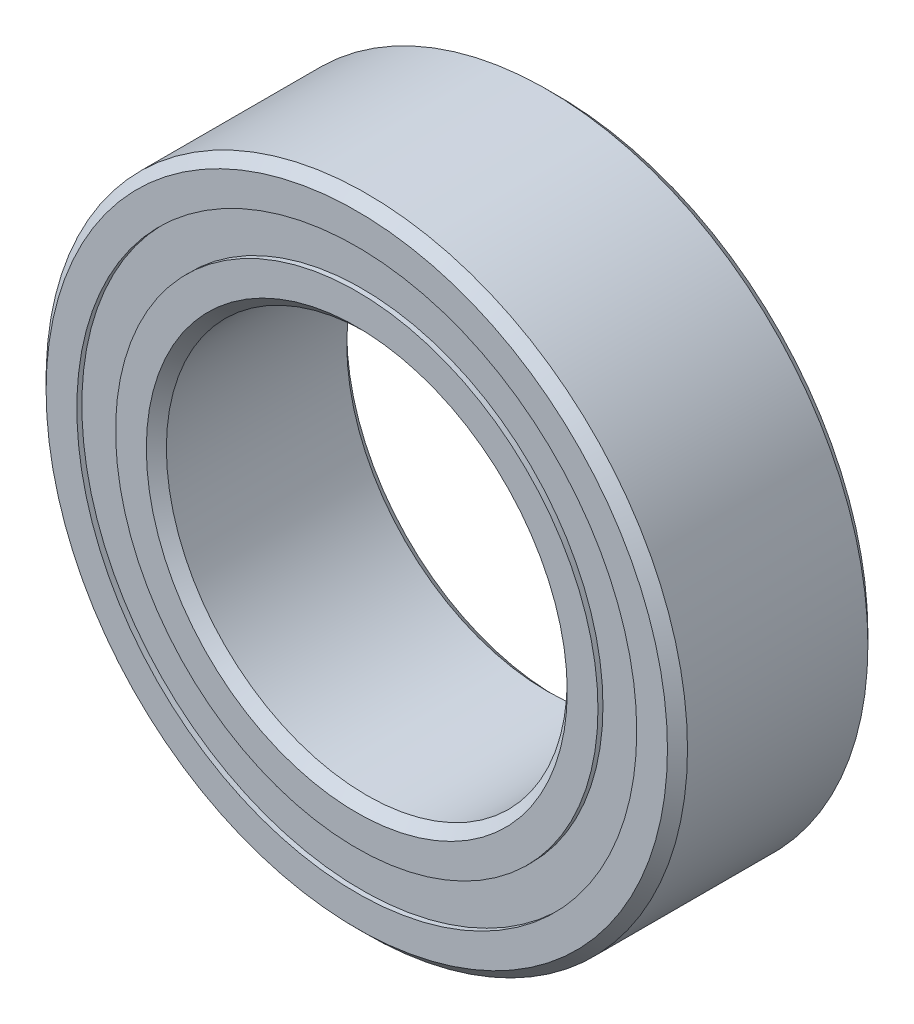
ISO-10303-21;
HEADER;
FILE_DESCRIPTION(('STEP AP214'),'2;1');
FILE_NAME('part.step','',(''),(''),'','','');
FILE_SCHEMA(('AUTOMOTIVE_DESIGN { 1 0 10303 214 1 1 1 1 }'));
ENDSEC;
DATA;
#1=APPLICATION_CONTEXT('core data for automotive mechanical design processes');
#2=APPLICATION_PROTOCOL_DEFINITION('international standard','automotive_design',2000,#1);
#3=PRODUCT_CONTEXT('',#1,'mechanical');
#4=PRODUCT('Part','Part','',(#3));
#5=PRODUCT_RELATED_PRODUCT_CATEGORY('part','',(#4));
#6=PRODUCT_DEFINITION_FORMATION('','',#4);
#7=PRODUCT_DEFINITION_CONTEXT('part definition',#1,'design');
#8=PRODUCT_DEFINITION('design','',#6,#7);
#9=PRODUCT_DEFINITION_SHAPE('','',#8);
#10=(LENGTH_UNIT() NAMED_UNIT(*) SI_UNIT(.MILLI.,.METRE.));
#11=(NAMED_UNIT(*) PLANE_ANGLE_UNIT() SI_UNIT($,.RADIAN.));
#12=(NAMED_UNIT(*) SI_UNIT($,.STERADIAN.) SOLID_ANGLE_UNIT());
#13=UNCERTAINTY_MEASURE_WITH_UNIT(LENGTH_MEASURE(1.E-05),#10,'distance_accuracy_value','');
#14=(GEOMETRIC_REPRESENTATION_CONTEXT(3) GLOBAL_UNCERTAINTY_ASSIGNED_CONTEXT((#13)) GLOBAL_UNIT_ASSIGNED_CONTEXT((#10,
#11,#12)) REPRESENTATION_CONTEXT('',''));
#15=CARTESIAN_POINT('',(0.,0.,0.));
#16=DIRECTION('',(0.,0.,1.));
#17=DIRECTION('',(1.,0.,0.));
#18=AXIS2_PLACEMENT_3D('',#15,#16,#17);
#19=CARTESIAN_POINT('',(0.,3.49175824175824,-1.1875));
#20=DIRECTION('',(0.,0.,1.));
#21=DIRECTION('',(1.,0.,0.));
#22=AXIS2_PLACEMENT_3D('',#19,#20,#21);
#23=PLANE('',#22);
#24=CARTESIAN_POINT('',(0.,0.,-1.1875));
#25=DIRECTION('',(0.,0.,1.));
#26=DIRECTION('',(1.,0.,0.));
#27=AXIS2_PLACEMENT_3D('',#24,#25,#26);
#28=CIRCLE('',#27,3.49175824175824);
#29=CARTESIAN_POINT('',(3.49175824175824,0.,-1.1875));
#30=VERTEX_POINT('',#29);
#31=EDGE_CURVE('E56',#30,#30,#28,.T.);
#32=ORIENTED_EDGE('',*,*,#31,.F.);
#33=EDGE_LOOP('',(#32));
#34=FACE_BOUND('',#33,.T.);
#35=CARTESIAN_POINT('',(0.,0.,-1.1875));
#36=DIRECTION('',(0.,0.,1.));
#37=DIRECTION('',(1.,0.,0.));
#38=AXIS2_PLACEMENT_3D('',#35,#36,#37);
#39=CIRCLE('',#38,3.00824175824176);
#40=CARTESIAN_POINT('',(3.00824175824176,0.,-1.1875));
#41=VERTEX_POINT('',#40);
#42=EDGE_CURVE('E11',#41,#41,#39,.T.);
#43=ORIENTED_EDGE('',*,*,#42,.T.);
#44=EDGE_LOOP('',(#43));
#45=FACE_BOUND('',#44,.T.);
#46=ADVANCED_FACE('F42',(#34,#45),#23,.F.);
#47=CARTESIAN_POINT('',(0.,0.,1.25));
#48=DIRECTION('',(0.,0.,1.));
#49=DIRECTION('',(1.,0.,0.));
#50=AXIS2_PLACEMENT_3D('',#47,#48,#49);
#51=CYLINDRICAL_SURFACE('',#50,3.00824175824176);
#52=ORIENTED_EDGE('',*,*,#42,.F.);
#53=EDGE_LOOP('',(#52));
#54=FACE_BOUND('',#53,.T.);
#55=CARTESIAN_POINT('',(0.,0.,-0.605878719519574));
#56=DIRECTION('',(0.,0.,1.));
#57=DIRECTION('',(1.,0.,0.));
#58=AXIS2_PLACEMENT_3D('',#55,#56,#57);
#59=CIRCLE('',#58,3.00824175824176);
#60=CARTESIAN_POINT('',(3.00824175824176,0.,-0.605878719519574));
#61=VERTEX_POINT('',#60);
#62=EDGE_CURVE('E48',#61,#61,#59,.T.);
#63=ORIENTED_EDGE('',*,*,#62,.T.);
#64=EDGE_LOOP('',(#63));
#65=FACE_BOUND('',#64,.T.);
#66=ADVANCED_FACE('F65',(#54,#65),#51,.F.);
#67=CARTESIAN_POINT('',(0.,3.49175824175824,-0.605878719519574));
#68=DIRECTION('',(0.,0.,-1.));
#69=DIRECTION('',(-1.,0.,0.));
#70=AXIS2_PLACEMENT_3D('',#67,#68,#69);
#71=PLANE('',#70);
#72=ORIENTED_EDGE('',*,*,#62,.F.);
#73=EDGE_LOOP('',(#72));
#74=FACE_BOUND('',#73,.T.);
#75=CARTESIAN_POINT('',(0.,0.,-0.605878719519574));
#76=DIRECTION('',(0.,0.,1.));
#77=DIRECTION('',(1.,0.,0.));
#78=AXIS2_PLACEMENT_3D('',#75,#76,#77);
#79=CIRCLE('',#78,3.49175824175824);
#80=CARTESIAN_POINT('',(3.49175824175824,0.,-0.605878719519574));
#81=VERTEX_POINT('',#80);
#82=EDGE_CURVE('E52',#81,#81,#79,.T.);
#83=ORIENTED_EDGE('',*,*,#82,.T.);
#84=EDGE_LOOP('',(#83));
#85=FACE_BOUND('',#84,.T.);
#86=ADVANCED_FACE('F69',(#74,#85),#71,.F.);
#87=CARTESIAN_POINT('',(0.,0.,1.25));
#88=DIRECTION('',(0.,0.,1.));
#89=DIRECTION('',(1.,0.,0.));
#90=AXIS2_PLACEMENT_3D('',#87,#88,#89);
#91=CYLINDRICAL_SURFACE('',#90,3.49175824175824);
#92=ORIENTED_EDGE('',*,*,#82,.F.);
#93=EDGE_LOOP('',(#92));
#94=FACE_BOUND('',#93,.T.);
#95=ORIENTED_EDGE('',*,*,#31,.T.);
#96=EDGE_LOOP('',(#95));
#97=FACE_BOUND('',#96,.T.);
#98=ADVANCED_FACE('F62',(#94,#97),#91,.T.);
#99=CLOSED_SHELL('',(#46,#66,#86,#98));
#100=MANIFOLD_SOLID_BREP('B2',#99);
#101=CARTESIAN_POINT('',(0.,3.49175824175824,1.1875));
#102=DIRECTION('',(0.,0.,-1.));
#103=DIRECTION('',(-1.,0.,0.));
#104=AXIS2_PLACEMENT_3D('',#101,#102,#103);
#105=PLANE('',#104);
#106=CARTESIAN_POINT('',(0.,0.,1.1875));
#107=DIRECTION('',(0.,0.,1.));
#108=DIRECTION('',(1.,0.,0.));
#109=AXIS2_PLACEMENT_3D('',#106,#107,#108);
#110=CIRCLE('',#109,3.00824175824176);
#111=CARTESIAN_POINT('',(3.00824175824176,0.,1.1875));
#112=VERTEX_POINT('',#111);
#113=EDGE_CURVE('E41',#112,#112,#110,.T.);
#114=ORIENTED_EDGE('',*,*,#113,.F.);
#115=EDGE_LOOP('',(#114));
#116=FACE_BOUND('',#115,.T.);
#117=CARTESIAN_POINT('',(0.,0.,1.1875));
#118=DIRECTION('',(0.,0.,1.));
#119=DIRECTION('',(1.,0.,0.));
#120=AXIS2_PLACEMENT_3D('',#117,#118,#119);
#121=CIRCLE('',#120,3.49175824175824);
#122=CARTESIAN_POINT('',(3.49175824175824,0.,1.1875));
#123=VERTEX_POINT('',#122);
#124=EDGE_CURVE('E124',#123,#123,#121,.T.);
#125=ORIENTED_EDGE('',*,*,#124,.T.);
#126=EDGE_LOOP('',(#125));
#127=FACE_BOUND('',#126,.T.);
#128=ADVANCED_FACE('F110',(#116,#127),#105,.F.);
#129=CARTESIAN_POINT('',(0.,0.,1.25));
#130=DIRECTION('',(0.,0.,1.));
#131=DIRECTION('',(1.,0.,0.));
#132=AXIS2_PLACEMENT_3D('',#129,#130,#131);
#133=CYLINDRICAL_SURFACE('',#132,3.00824175824176);
#134=CARTESIAN_POINT('',(0.,0.,0.605878719519573));
#135=DIRECTION('',(0.,0.,1.));
#136=DIRECTION('',(1.,0.,0.));
#137=AXIS2_PLACEMENT_3D('',#134,#135,#136);
#138=CIRCLE('',#137,3.00824175824176);
#139=CARTESIAN_POINT('',(3.00824175824176,0.,0.605878719519573));
#140=VERTEX_POINT('',#139);
#141=EDGE_CURVE('E116',#140,#140,#138,.T.);
#142=ORIENTED_EDGE('',*,*,#141,.F.);
#143=EDGE_LOOP('',(#142));
#144=FACE_BOUND('',#143,.T.);
#145=ORIENTED_EDGE('',*,*,#113,.T.);
#146=EDGE_LOOP('',(#145));
#147=FACE_BOUND('',#146,.T.);
#148=ADVANCED_FACE('F139',(#144,#147),#133,.F.);
#149=CARTESIAN_POINT('',(0.,3.49175824175824,0.605878719519573));
#150=DIRECTION('',(0.,0.,1.));
#151=DIRECTION('',(1.,0.,0.));
#152=AXIS2_PLACEMENT_3D('',#149,#150,#151);
#153=PLANE('',#152);
#154=CARTESIAN_POINT('',(0.,0.,0.605878719519573));
#155=DIRECTION('',(0.,0.,1.));
#156=DIRECTION('',(1.,0.,0.));
#157=AXIS2_PLACEMENT_3D('',#154,#155,#156);
#158=CIRCLE('',#157,3.49175824175824);
#159=CARTESIAN_POINT('',(3.49175824175824,0.,0.605878719519573));
#160=VERTEX_POINT('',#159);
#161=EDGE_CURVE('E120',#160,#160,#158,.T.);
#162=ORIENTED_EDGE('',*,*,#161,.F.);
#163=EDGE_LOOP('',(#162));
#164=FACE_BOUND('',#163,.T.);
#165=ORIENTED_EDGE('',*,*,#141,.T.);
#166=EDGE_LOOP('',(#165));
#167=FACE_BOUND('',#166,.T.);
#168=ADVANCED_FACE('F134',(#164,#167),#153,.F.);
#169=CARTESIAN_POINT('',(0.,0.,1.25));
#170=DIRECTION('',(0.,0.,1.));
#171=DIRECTION('',(1.,0.,0.));
#172=AXIS2_PLACEMENT_3D('',#169,#170,#171);
#173=CYLINDRICAL_SURFACE('',#172,3.49175824175824);
#174=ORIENTED_EDGE('',*,*,#124,.F.);
#175=EDGE_LOOP('',(#174));
#176=FACE_BOUND('',#175,.T.);
#177=ORIENTED_EDGE('',*,*,#161,.T.);
#178=EDGE_LOOP('',(#177));
#179=FACE_BOUND('',#178,.T.);
#180=ADVANCED_FACE('F131',(#176,#179),#173,.T.);
#181=CLOSED_SHELL('',(#128,#148,#168,#180));
#182=MANIFOLD_SOLID_BREP('B6',#181);
#183=CARTESIAN_POINT('',(-1.62499999999996,2.81458256229945,0.));
#184=DIRECTION('',(0.,0.,1.));
#185=DIRECTION('',(-0.499999999999989,0.866025403784445,0.));
#186=AXIS2_PLACEMENT_3D('',#183,#184,#185);
#187=SPHERICAL_SURFACE('',#186,0.605878719519574);
#188=CARTESIAN_POINT('',(-1.62499999999996,2.81458256229945,0.605878719519573));
#189=VERTEX_POINT('',#188);
#190=VERTEX_LOOP('',#189);
#191=FACE_BOUND('',#190,.T.);
#192=ADVANCED_FACE('F177',(#191),#187,.T.);
#193=CLOSED_SHELL('',(#192));
#194=MANIFOLD_SOLID_BREP('B36',#193);
#195=CARTESIAN_POINT('',(-2.81458256229941,1.62500000000003,0.));
#196=DIRECTION('',(0.,0.,1.));
#197=DIRECTION('',(-0.866025403784433,0.50000000000001,0.));
#198=AXIS2_PLACEMENT_3D('',#195,#196,#197);
#199=SPHERICAL_SURFACE('',#198,0.605878719519574);
#200=CARTESIAN_POINT('',(-2.81458256229941,1.62500000000003,0.605878719519573));
#201=VERTEX_POINT('',#200);
#202=VERTEX_LOOP('',#201);
#203=FACE_BOUND('',#202,.T.);
#204=ADVANCED_FACE('F197',(#203),#199,.T.);
#205=CLOSED_SHELL('',(#204));
#206=MANIFOLD_SOLID_BREP('B106',#205);
#207=CARTESIAN_POINT('',(-3.25,0.,0.));
#208=DIRECTION('',(0.,0.,1.));
#209=DIRECTION('',(-1.,0.,0.));
#210=AXIS2_PLACEMENT_3D('',#207,#208,#209);
#211=SPHERICAL_SURFACE('',#210,0.605878719519574);
#212=CARTESIAN_POINT('',(-3.25,0.,0.605878719519573));
#213=VERTEX_POINT('',#212);
#214=VERTEX_LOOP('',#213);
#215=FACE_BOUND('',#214,.T.);
#216=ADVANCED_FACE('F217',(#215),#211,.T.);
#217=CLOSED_SHELL('',(#216));
#218=MANIFOLD_SOLID_BREP('B173',#217);
#219=CARTESIAN_POINT('',(-2.81458256229944,-1.62499999999997,0.));
#220=DIRECTION('',(0.,0.,1.));
#221=DIRECTION('',(-0.866025403784443,-0.499999999999992,0.));
#222=AXIS2_PLACEMENT_3D('',#219,#220,#221);
#223=SPHERICAL_SURFACE('',#222,0.605878719519574);
#224=CARTESIAN_POINT('',(-2.81458256229944,-1.62499999999997,0.605878719519573));
#225=VERTEX_POINT('',#224);
#226=VERTEX_LOOP('',#225);
#227=FACE_BOUND('',#226,.T.);
#228=ADVANCED_FACE('F237',(#227),#223,.T.);
#229=CLOSED_SHELL('',(#228));
#230=MANIFOLD_SOLID_BREP('B193',#229);
#231=CARTESIAN_POINT('',(-1.62500000000002,-2.81458256229941,0.));
#232=DIRECTION('',(0.,0.,1.));
#233=DIRECTION('',(-0.500000000000007,-0.866025403784435,0.));
#234=AXIS2_PLACEMENT_3D('',#231,#232,#233);
#235=SPHERICAL_SURFACE('',#234,0.605878719519574);
#236=CARTESIAN_POINT('',(-1.62500000000002,-2.81458256229941,0.605878719519573));
#237=VERTEX_POINT('',#236);
#238=VERTEX_LOOP('',#237);
#239=FACE_BOUND('',#238,.T.);
#240=ADVANCED_FACE('F257',(#239),#235,.T.);
#241=CLOSED_SHELL('',(#240));
#242=MANIFOLD_SOLID_BREP('B213',#241);
#243=CARTESIAN_POINT('',(0.,-3.25,0.));
#244=DIRECTION('',(0.,0.,1.));
#245=DIRECTION('',(0.,-1.,0.));
#246=AXIS2_PLACEMENT_3D('',#243,#244,#245);
#247=SPHERICAL_SURFACE('',#246,0.605878719519574);
#248=CARTESIAN_POINT('',(0.,-3.25,0.605878719519573));
#249=VERTEX_POINT('',#248);
#250=VERTEX_LOOP('',#249);
#251=FACE_BOUND('',#250,.T.);
#252=ADVANCED_FACE('F277',(#251),#247,.T.);
#253=CLOSED_SHELL('',(#252));
#254=MANIFOLD_SOLID_BREP('B233',#253);
#255=CARTESIAN_POINT('',(1.62499999999998,-2.81458256229944,0.));
#256=DIRECTION('',(0.,0.,1.));
#257=DIRECTION('',(0.499999999999995,-0.866025403784442,0.));
#258=AXIS2_PLACEMENT_3D('',#255,#256,#257);
#259=SPHERICAL_SURFACE('',#258,0.605878719519574);
#260=CARTESIAN_POINT('',(1.62499999999998,-2.81458256229944,0.605878719519573));
#261=VERTEX_POINT('',#260);
#262=VERTEX_LOOP('',#261);
#263=FACE_BOUND('',#262,.T.);
#264=ADVANCED_FACE('F297',(#263),#259,.T.);
#265=CLOSED_SHELL('',(#264));
#266=MANIFOLD_SOLID_BREP('B253',#265);
#267=CARTESIAN_POINT('',(2.81458256229942,-1.62500000000001,0.));
#268=DIRECTION('',(0.,0.,1.));
#269=DIRECTION('',(0.866025403784436,-0.500000000000004,0.));
#270=AXIS2_PLACEMENT_3D('',#267,#268,#269);
#271=SPHERICAL_SURFACE('',#270,0.605878719519574);
#272=CARTESIAN_POINT('',(2.81458256229942,-1.62500000000001,0.605878719519573));
#273=VERTEX_POINT('',#272);
#274=VERTEX_LOOP('',#273);
#275=FACE_BOUND('',#274,.T.);
#276=ADVANCED_FACE('F317',(#275),#271,.T.);
#277=CLOSED_SHELL('',(#276));
#278=MANIFOLD_SOLID_BREP('B273',#277);
#279=CARTESIAN_POINT('',(3.25,0.,0.));
#280=DIRECTION('',(0.,0.,1.));
#281=DIRECTION('',(1.,0.,0.));
#282=AXIS2_PLACEMENT_3D('',#279,#280,#281);
#283=SPHERICAL_SURFACE('',#282,0.605878719519574);
#284=CARTESIAN_POINT('',(3.25,0.,0.605878719519573));
#285=VERTEX_POINT('',#284);
#286=VERTEX_LOOP('',#285);
#287=FACE_BOUND('',#286,.T.);
#288=ADVANCED_FACE('F337',(#287),#283,.T.);
#289=CLOSED_SHELL('',(#288));
#290=MANIFOLD_SOLID_BREP('B293',#289);
#291=CARTESIAN_POINT('',(2.81458256229943,1.62499999999999,0.));
#292=DIRECTION('',(0.,0.,1.));
#293=DIRECTION('',(0.86602540378444,0.499999999999998,0.));
#294=AXIS2_PLACEMENT_3D('',#291,#292,#293);
#295=SPHERICAL_SURFACE('',#294,0.605878719519574);
#296=CARTESIAN_POINT('',(2.81458256229943,1.62499999999999,0.605878719519573));
#297=VERTEX_POINT('',#296);
#298=VERTEX_LOOP('',#297);
#299=FACE_BOUND('',#298,.T.);
#300=ADVANCED_FACE('F357',(#299),#295,.T.);
#301=CLOSED_SHELL('',(#300));
#302=MANIFOLD_SOLID_BREP('B313',#301);
#303=CARTESIAN_POINT('',(1.625,2.81458256229942,0.));
#304=DIRECTION('',(0.,0.,1.));
#305=DIRECTION('',(0.500000000000001,0.866025403784438,0.));
#306=AXIS2_PLACEMENT_3D('',#303,#304,#305);
#307=SPHERICAL_SURFACE('',#306,0.605878719519574);
#308=CARTESIAN_POINT('',(1.625,2.81458256229942,0.605878719519573));
#309=VERTEX_POINT('',#308);
#310=VERTEX_LOOP('',#309);
#311=FACE_BOUND('',#310,.T.);
#312=ADVANCED_FACE('F377',(#311),#307,.T.);
#313=CLOSED_SHELL('',(#312));
#314=MANIFOLD_SOLID_BREP('B333',#313);
#315=CARTESIAN_POINT('',(0.,3.25,0.));
#316=DIRECTION('',(0.,0.,1.));
#317=DIRECTION('',(0.,1.,0.));
#318=AXIS2_PLACEMENT_3D('',#315,#316,#317);
#319=SPHERICAL_SURFACE('',#318,0.605878719519574);
#320=CARTESIAN_POINT('',(0.,3.25,0.605878719519573));
#321=VERTEX_POINT('',#320);
#322=VERTEX_LOOP('',#321);
#323=FACE_BOUND('',#322,.T.);
#324=ADVANCED_FACE('F400',(#323),#319,.T.);
#325=CLOSED_SHELL('',(#324));
#326=MANIFOLD_SOLID_BREP('B353',#325);
#327=CARTESIAN_POINT('',(0.,3.00824175824176,1.25));
#328=DIRECTION('',(0.,0.,-1.));
#329=DIRECTION('',(-1.,0.,0.));
#330=AXIS2_PLACEMENT_3D('',#327,#328,#329);
#331=PLANE('',#330);
#332=CARTESIAN_POINT('',(0.,0.,1.25));
#333=DIRECTION('',(0.,0.,1.));
#334=DIRECTION('',(1.,0.,0.));
#335=AXIS2_PLACEMENT_3D('',#332,#333,#334);
#336=CIRCLE('',#335,2.625);
#337=CARTESIAN_POINT('',(2.625,0.,1.25));
#338=VERTEX_POINT('',#337);
#339=EDGE_CURVE('E448',#338,#338,#336,.T.);
#340=ORIENTED_EDGE('',*,*,#339,.F.);
#341=EDGE_LOOP('',(#340));
#342=FACE_BOUND('',#341,.T.);
#343=CARTESIAN_POINT('',(0.,0.,1.25));
#344=DIRECTION('',(0.,0.,1.));
#345=DIRECTION('',(1.,0.,0.));
#346=AXIS2_PLACEMENT_3D('',#343,#344,#345);
#347=CIRCLE('',#346,3.00824175824176);
#348=CARTESIAN_POINT('',(3.00824175824176,0.,1.25));
#349=VERTEX_POINT('',#348);
#350=EDGE_CURVE('E399',#349,#349,#347,.T.);
#351=ORIENTED_EDGE('',*,*,#350,.T.);
#352=EDGE_LOOP('',(#351));
#353=FACE_BOUND('',#352,.T.);
#354=ADVANCED_FACE('F420',(#342,#353),#331,.F.);
#355=CARTESIAN_POINT('',(0.,0.,1.25));
#356=DIRECTION('',(0.,0.,1.));
#357=DIRECTION('',(1.,0.,0.));
#358=AXIS2_PLACEMENT_3D('',#355,#356,#357);
#359=CYLINDRICAL_SURFACE('',#358,3.00824175824176);
#360=ORIENTED_EDGE('',*,*,#350,.F.);
#361=EDGE_LOOP('',(#360));
#362=FACE_BOUND('',#361,.T.);
#363=CARTESIAN_POINT('',(0.,0.,0.555555555555555));
#364=DIRECTION('',(0.,0.,1.));
#365=DIRECTION('',(1.,0.,0.));
#366=AXIS2_PLACEMENT_3D('',#363,#364,#365);
#367=CIRCLE('',#366,3.00824175824176);
#368=CARTESIAN_POINT('',(3.00824175824176,0.,0.555555555555555));
#369=VERTEX_POINT('',#368);
#370=EDGE_CURVE('E426',#369,#369,#367,.T.);
#371=ORIENTED_EDGE('',*,*,#370,.T.);
#372=EDGE_LOOP('',(#371));
#373=FACE_BOUND('',#372,.T.);
#374=ADVANCED_FACE('F455',(#362,#373),#359,.T.);
#375=CARTESIAN_POINT('',(0.,0.,0.));
#376=DIRECTION('',(0.,0.,1.));
#377=DIRECTION('',(1.,0.,0.));
#378=AXIS2_PLACEMENT_3D('',#375,#376,#377);
#379=TOROIDAL_SURFACE('',#378,3.25,0.605878719519572);
#380=ORIENTED_EDGE('',*,*,#370,.F.);
#381=EDGE_LOOP('',(#380));
#382=FACE_BOUND('',#381,.T.);
#383=CARTESIAN_POINT('',(0.,0.,-0.555555555555556));
#384=DIRECTION('',(0.,0.,1.));
#385=DIRECTION('',(1.,0.,0.));
#386=AXIS2_PLACEMENT_3D('',#383,#384,#385);
#387=CIRCLE('',#386,3.00824175824176);
#388=CARTESIAN_POINT('',(3.00824175824176,0.,-0.555555555555556));
#389=VERTEX_POINT('',#388);
#390=EDGE_CURVE('E430',#389,#389,#387,.T.);
#391=ORIENTED_EDGE('',*,*,#390,.T.);
#392=EDGE_LOOP('',(#391));
#393=FACE_BOUND('',#392,.T.);
#394=ADVANCED_FACE('F459',(#382,#393),#379,.F.);
#395=CARTESIAN_POINT('',(0.,0.,1.25));
#396=DIRECTION('',(0.,0.,1.));
#397=DIRECTION('',(1.,0.,0.));
#398=AXIS2_PLACEMENT_3D('',#395,#396,#397);
#399=CYLINDRICAL_SURFACE('',#398,3.00824175824176);
#400=ORIENTED_EDGE('',*,*,#390,.F.);
#401=EDGE_LOOP('',(#400));
#402=FACE_BOUND('',#401,.T.);
#403=CARTESIAN_POINT('',(0.,0.,-1.25));
#404=DIRECTION('',(0.,0.,1.));
#405=DIRECTION('',(1.,0.,0.));
#406=AXIS2_PLACEMENT_3D('',#403,#404,#405);
#407=CIRCLE('',#406,3.00824175824176);
#408=CARTESIAN_POINT('',(3.00824175824176,0.,-1.25));
#409=VERTEX_POINT('',#408);
#410=EDGE_CURVE('E434',#409,#409,#407,.T.);
#411=ORIENTED_EDGE('',*,*,#410,.T.);
#412=EDGE_LOOP('',(#411));
#413=FACE_BOUND('',#412,.T.);
#414=ADVANCED_FACE('F464',(#402,#413),#399,.T.);
#415=CARTESIAN_POINT('',(0.,2.625,-1.25));
#416=DIRECTION('',(0.,0.,1.));
#417=DIRECTION('',(1.,0.,0.));
#418=AXIS2_PLACEMENT_3D('',#415,#416,#417);
#419=PLANE('',#418);
#420=ORIENTED_EDGE('',*,*,#410,.F.);
#421=EDGE_LOOP('',(#420));
#422=FACE_BOUND('',#421,.T.);
#423=CARTESIAN_POINT('',(0.,0.,-1.25));
#424=DIRECTION('',(0.,0.,1.));
#425=DIRECTION('',(1.,0.,0.));
#426=AXIS2_PLACEMENT_3D('',#423,#424,#425);
#427=CIRCLE('',#426,2.625);
#428=CARTESIAN_POINT('',(2.625,0.,-1.25));
#429=VERTEX_POINT('',#428);
#430=EDGE_CURVE('E439',#429,#429,#427,.T.);
#431=ORIENTED_EDGE('',*,*,#430,.T.);
#432=EDGE_LOOP('',(#431));
#433=FACE_BOUND('',#432,.T.);
#434=ADVANCED_FACE('F470',(#422,#433),#419,.F.);
#435=CARTESIAN_POINT('',(0.,0.,-1.125));
#436=DIRECTION('',(0.,0.,-1.));
#437=DIRECTION('',(-1.,0.,0.));
#438=AXIS2_PLACEMENT_3D('',#435,#436,#437);
#439=CONICAL_SURFACE('',#438,2.5,0.785398163397443);
#440=ORIENTED_EDGE('',*,*,#430,.F.);
#441=EDGE_LOOP('',(#440));
#442=FACE_BOUND('',#441,.T.);
#443=CARTESIAN_POINT('',(0.,0.,-1.125));
#444=DIRECTION('',(0.,0.,1.));
#445=DIRECTION('',(1.,0.,0.));
#446=AXIS2_PLACEMENT_3D('',#443,#444,#445);
#447=CIRCLE('',#446,2.5);
#448=CARTESIAN_POINT('',(2.5,0.,-1.125));
#449=VERTEX_POINT('',#448);
#450=EDGE_CURVE('E442',#449,#449,#447,.T.);
#451=ORIENTED_EDGE('',*,*,#450,.T.);
#452=EDGE_LOOP('',(#451));
#453=FACE_BOUND('',#452,.T.);
#454=ADVANCED_FACE('F474',(#442,#453),#439,.F.);
#455=CARTESIAN_POINT('',(0.,0.,1.25));
#456=DIRECTION('',(0.,0.,1.));
#457=DIRECTION('',(1.,0.,0.));
#458=AXIS2_PLACEMENT_3D('',#455,#456,#457);
#459=CYLINDRICAL_SURFACE('',#458,2.5);
#460=ORIENTED_EDGE('',*,*,#450,.F.);
#461=EDGE_LOOP('',(#460));
#462=FACE_BOUND('',#461,.T.);
#463=CARTESIAN_POINT('',(0.,0.,1.125));
#464=DIRECTION('',(0.,0.,1.));
#465=DIRECTION('',(1.,0.,0.));
#466=AXIS2_PLACEMENT_3D('',#463,#464,#465);
#467=CIRCLE('',#466,2.5);
#468=CARTESIAN_POINT('',(2.5,0.,1.125));
#469=VERTEX_POINT('',#468);
#470=EDGE_CURVE('E445',#469,#469,#467,.T.);
#471=ORIENTED_EDGE('',*,*,#470,.T.);
#472=EDGE_LOOP('',(#471));
#473=FACE_BOUND('',#472,.T.);
#474=ADVANCED_FACE('F478',(#462,#473),#459,.F.);
#475=CARTESIAN_POINT('',(0.,0.,1.25));
#476=DIRECTION('',(0.,0.,1.));
#477=DIRECTION('',(1.,0.,0.));
#478=AXIS2_PLACEMENT_3D('',#475,#476,#477);
#479=CONICAL_SURFACE('',#478,2.625,0.785398163397454);
#480=ORIENTED_EDGE('',*,*,#470,.F.);
#481=EDGE_LOOP('',(#480));
#482=FACE_BOUND('',#481,.T.);
#483=ORIENTED_EDGE('',*,*,#339,.T.);
#484=EDGE_LOOP('',(#483));
#485=FACE_BOUND('',#484,.T.);
#486=ADVANCED_FACE('F452',(#482,#485),#479,.F.);
#487=CLOSED_SHELL('',(#354,#374,#394,#414,#434,#454,#474,#486));
#488=MANIFOLD_SOLID_BREP('B373',#487);
#489=CARTESIAN_POINT('',(0.,0.,1.125));
#490=DIRECTION('',(0.,0.,-1.));
#491=DIRECTION('',(-1.,0.,0.));
#492=AXIS2_PLACEMENT_3D('',#489,#490,#491);
#493=CONICAL_SURFACE('',#492,4.,0.785398163397446);
#494=CARTESIAN_POINT('',(0.,0.,1.25));
#495=DIRECTION('',(0.,0.,1.));
#496=DIRECTION('',(1.,0.,0.));
#497=AXIS2_PLACEMENT_3D('',#494,#495,#496);
#498=CIRCLE('',#497,3.875);
#499=CARTESIAN_POINT('',(3.875,0.,1.25));
#500=VERTEX_POINT('',#499);
#501=EDGE_CURVE('E570',#500,#500,#498,.T.);
#502=ORIENTED_EDGE('',*,*,#501,.F.);
#503=EDGE_LOOP('',(#502));
#504=FACE_BOUND('',#503,.T.);
#505=CARTESIAN_POINT('',(0.,0.,1.125));
#506=DIRECTION('',(0.,0.,1.));
#507=DIRECTION('',(1.,0.,0.));
#508=AXIS2_PLACEMENT_3D('',#505,#506,#507);
#509=CIRCLE('',#508,4.);
#510=CARTESIAN_POINT('',(4.,0.,1.125));
#511=VERTEX_POINT('',#510);
#512=EDGE_CURVE('E419',#511,#511,#509,.T.);
#513=ORIENTED_EDGE('',*,*,#512,.T.);
#514=EDGE_LOOP('',(#513));
#515=FACE_BOUND('',#514,.T.);
#516=ADVANCED_FACE('F542',(#504,#515),#493,.T.);
#517=CARTESIAN_POINT('',(0.,0.,1.25));
#518=DIRECTION('',(0.,0.,1.));
#519=DIRECTION('',(1.,0.,0.));
#520=AXIS2_PLACEMENT_3D('',#517,#518,#519);
#521=CYLINDRICAL_SURFACE('',#520,4.);
#522=ORIENTED_EDGE('',*,*,#512,.F.);
#523=EDGE_LOOP('',(#522));
#524=FACE_BOUND('',#523,.T.);
#525=CARTESIAN_POINT('',(0.,0.,-1.125));
#526=DIRECTION('',(0.,0.,1.));
#527=DIRECTION('',(1.,0.,0.));
#528=AXIS2_PLACEMENT_3D('',#525,#526,#527);
#529=CIRCLE('',#528,4.);
#530=CARTESIAN_POINT('',(4.,0.,-1.125));
#531=VERTEX_POINT('',#530);
#532=EDGE_CURVE('E548',#531,#531,#529,.T.);
#533=ORIENTED_EDGE('',*,*,#532,.T.);
#534=EDGE_LOOP('',(#533));
#535=FACE_BOUND('',#534,.T.);
#536=ADVANCED_FACE('F577',(#524,#535),#521,.T.);
#537=CARTESIAN_POINT('',(0.,0.,-1.25));
#538=DIRECTION('',(0.,0.,1.));
#539=DIRECTION('',(1.,0.,0.));
#540=AXIS2_PLACEMENT_3D('',#537,#538,#539);
#541=CONICAL_SURFACE('',#540,3.875,0.785398163397443);
#542=ORIENTED_EDGE('',*,*,#532,.F.);
#543=EDGE_LOOP('',(#542));
#544=FACE_BOUND('',#543,.T.);
#545=CARTESIAN_POINT('',(0.,0.,-1.25));
#546=DIRECTION('',(0.,0.,1.));
#547=DIRECTION('',(1.,0.,0.));
#548=AXIS2_PLACEMENT_3D('',#545,#546,#547);
#549=CIRCLE('',#548,3.875);
#550=CARTESIAN_POINT('',(3.875,0.,-1.25));
#551=VERTEX_POINT('',#550);
#552=EDGE_CURVE('E552',#551,#551,#549,.T.);
#553=ORIENTED_EDGE('',*,*,#552,.T.);
#554=EDGE_LOOP('',(#553));
#555=FACE_BOUND('',#554,.T.);
#556=ADVANCED_FACE('F581',(#544,#555),#541,.T.);
#557=CARTESIAN_POINT('',(0.,3.875,-1.25));
#558=DIRECTION('',(0.,0.,1.));
#559=DIRECTION('',(1.,0.,0.));
#560=AXIS2_PLACEMENT_3D('',#557,#558,#559);
#561=PLANE('',#560);
#562=ORIENTED_EDGE('',*,*,#552,.F.);
#563=EDGE_LOOP('',(#562));
#564=FACE_BOUND('',#563,.T.);
#565=CARTESIAN_POINT('',(0.,0.,-1.25));
#566=DIRECTION('',(0.,0.,1.));
#567=DIRECTION('',(1.,0.,0.));
#568=AXIS2_PLACEMENT_3D('',#565,#566,#567);
#569=CIRCLE('',#568,3.49175824175824);
#570=CARTESIAN_POINT('',(3.49175824175824,0.,-1.25));
#571=VERTEX_POINT('',#570);
#572=EDGE_CURVE('E556',#571,#571,#569,.T.);
#573=ORIENTED_EDGE('',*,*,#572,.T.);
#574=EDGE_LOOP('',(#573));
#575=FACE_BOUND('',#574,.T.);
#576=ADVANCED_FACE('F586',(#564,#575),#561,.F.);
#577=CARTESIAN_POINT('',(0.,0.,1.25));
#578=DIRECTION('',(0.,0.,1.));
#579=DIRECTION('',(1.,0.,0.));
#580=AXIS2_PLACEMENT_3D('',#577,#578,#579);
#581=CYLINDRICAL_SURFACE('',#580,3.49175824175824);
#582=ORIENTED_EDGE('',*,*,#572,.F.);
#583=EDGE_LOOP('',(#582));
#584=FACE_BOUND('',#583,.T.);
#585=CARTESIAN_POINT('',(0.,0.,-0.555555555555556));
#586=DIRECTION('',(0.,0.,1.));
#587=DIRECTION('',(1.,0.,0.));
#588=AXIS2_PLACEMENT_3D('',#585,#586,#587);
#589=CIRCLE('',#588,3.49175824175824);
#590=CARTESIAN_POINT('',(3.49175824175824,0.,-0.555555555555556));
#591=VERTEX_POINT('',#590);
#592=EDGE_CURVE('E561',#591,#591,#589,.T.);
#593=ORIENTED_EDGE('',*,*,#592,.T.);
#594=EDGE_LOOP('',(#593));
#595=FACE_BOUND('',#594,.T.);
#596=ADVANCED_FACE('F592',(#584,#595),#581,.F.);
#597=CARTESIAN_POINT('',(0.,0.,0.));
#598=DIRECTION('',(0.,0.,1.));
#599=DIRECTION('',(1.,0.,0.));
#600=AXIS2_PLACEMENT_3D('',#597,#598,#599);
#601=TOROIDAL_SURFACE('',#600,3.25,0.605878719519574);
#602=ORIENTED_EDGE('',*,*,#592,.F.);
#603=EDGE_LOOP('',(#602));
#604=FACE_BOUND('',#603,.T.);
#605=CARTESIAN_POINT('',(0.,0.,0.555555555555555));
#606=DIRECTION('',(0.,0.,1.));
#607=DIRECTION('',(1.,0.,0.));
#608=AXIS2_PLACEMENT_3D('',#605,#606,#607);
#609=CIRCLE('',#608,3.49175824175824);
#610=CARTESIAN_POINT('',(3.49175824175824,0.,0.555555555555555));
#611=VERTEX_POINT('',#610);
#612=EDGE_CURVE('E564',#611,#611,#609,.T.);
#613=ORIENTED_EDGE('',*,*,#612,.T.);
#614=EDGE_LOOP('',(#613));
#615=FACE_BOUND('',#614,.T.);
#616=ADVANCED_FACE('F596',(#604,#615),#601,.F.);
#617=CARTESIAN_POINT('',(0.,0.,1.25));
#618=DIRECTION('',(0.,0.,1.));
#619=DIRECTION('',(1.,0.,0.));
#620=AXIS2_PLACEMENT_3D('',#617,#618,#619);
#621=CYLINDRICAL_SURFACE('',#620,3.49175824175824);
#622=ORIENTED_EDGE('',*,*,#612,.F.);
#623=EDGE_LOOP('',(#622));
#624=FACE_BOUND('',#623,.T.);
#625=CARTESIAN_POINT('',(0.,0.,1.25));
#626=DIRECTION('',(0.,0.,1.));
#627=DIRECTION('',(1.,0.,0.));
#628=AXIS2_PLACEMENT_3D('',#625,#626,#627);
#629=CIRCLE('',#628,3.49175824175824);
#630=CARTESIAN_POINT('',(3.49175824175824,0.,1.25));
#631=VERTEX_POINT('',#630);
#632=EDGE_CURVE('E567',#631,#631,#629,.T.);
#633=ORIENTED_EDGE('',*,*,#632,.T.);
#634=EDGE_LOOP('',(#633));
#635=FACE_BOUND('',#634,.T.);
#636=ADVANCED_FACE('F600',(#624,#635),#621,.F.);
#637=CARTESIAN_POINT('',(0.,3.875,1.25));
#638=DIRECTION('',(0.,0.,-1.));
#639=DIRECTION('',(-1.,0.,0.));
#640=AXIS2_PLACEMENT_3D('',#637,#638,#639);
#641=PLANE('',#640);
#642=ORIENTED_EDGE('',*,*,#632,.F.);
#643=EDGE_LOOP('',(#642));
#644=FACE_BOUND('',#643,.T.);
#645=ORIENTED_EDGE('',*,*,#501,.T.);
#646=EDGE_LOOP('',(#645));
#647=FACE_BOUND('',#646,.T.);
#648=ADVANCED_FACE('F574',(#644,#647),#641,.F.);
#649=CLOSED_SHELL('',(#516,#536,#556,#576,#596,#616,#636,#648));
#650=MANIFOLD_SOLID_BREP('B394',#649);
#651=ADVANCED_BREP_SHAPE_REPRESENTATION('',(#18,#100,#182,#194,#206,#218,#230,#242,#254,#266,
#278,#290,#302,#314,#326,#488,#650),#14);
#652=SHAPE_DEFINITION_REPRESENTATION(#9,#651);
ENDSEC;
END-ISO-10303-21;
